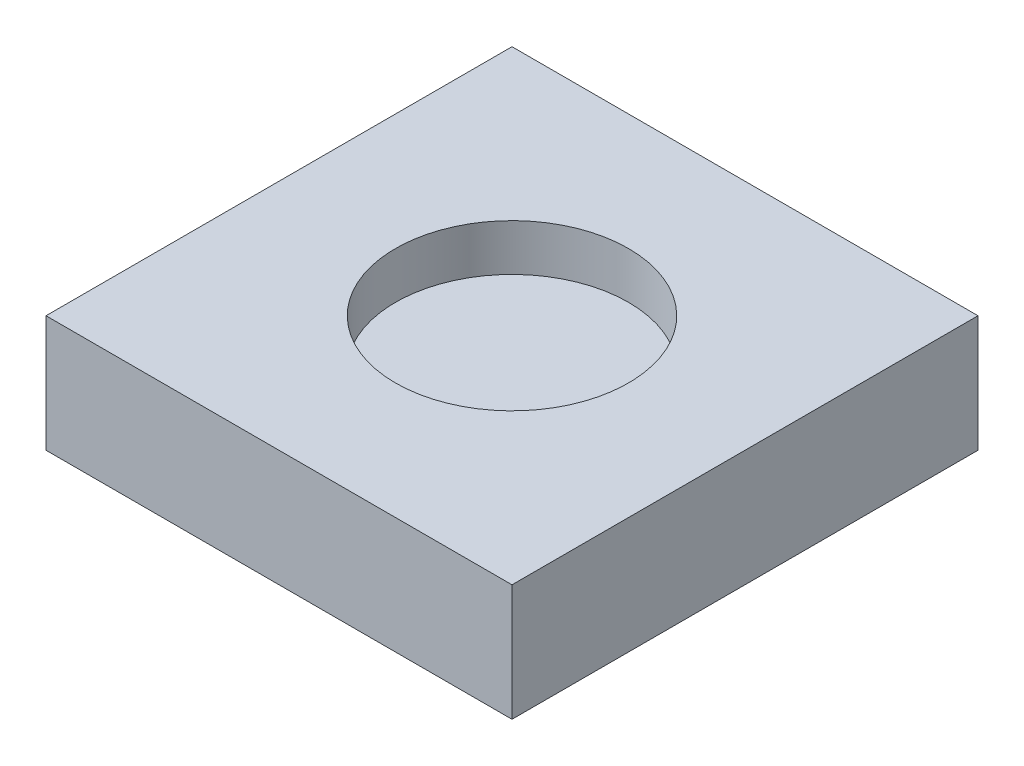
ISO-10303-21;
HEADER;
FILE_DESCRIPTION(('STEP AP214'),'2;1');
FILE_NAME('part.step','',(''),(''),'','','');
FILE_SCHEMA(('AUTOMOTIVE_DESIGN { 1 0 10303 214 1 1 1 1 }'));
ENDSEC;
DATA;
#1=APPLICATION_CONTEXT('core data for automotive mechanical design processes');
#2=APPLICATION_PROTOCOL_DEFINITION('international standard','automotive_design',2000,#1);
#3=PRODUCT_CONTEXT('',#1,'mechanical');
#4=PRODUCT('Part','Part','',(#3));
#5=PRODUCT_RELATED_PRODUCT_CATEGORY('part','',(#4));
#6=PRODUCT_DEFINITION_FORMATION('','',#4);
#7=PRODUCT_DEFINITION_CONTEXT('part definition',#1,'design');
#8=PRODUCT_DEFINITION('design','',#6,#7);
#9=PRODUCT_DEFINITION_SHAPE('','',#8);
#10=(LENGTH_UNIT() NAMED_UNIT(*) SI_UNIT(.MILLI.,.METRE.));
#11=(NAMED_UNIT(*) PLANE_ANGLE_UNIT() SI_UNIT($,.RADIAN.));
#12=(NAMED_UNIT(*) SI_UNIT($,.STERADIAN.) SOLID_ANGLE_UNIT());
#13=UNCERTAINTY_MEASURE_WITH_UNIT(LENGTH_MEASURE(1.E-05),#10,'distance_accuracy_value','');
#14=(GEOMETRIC_REPRESENTATION_CONTEXT(3) GLOBAL_UNCERTAINTY_ASSIGNED_CONTEXT((#13)) GLOBAL_UNIT_ASSIGNED_CONTEXT((#10,
#11,#12)) REPRESENTATION_CONTEXT('',''));
#15=CARTESIAN_POINT('',(0.,0.,0.));
#16=DIRECTION('',(0.,0.,1.));
#17=DIRECTION('',(1.,0.,0.));
#18=AXIS2_PLACEMENT_3D('',#15,#16,#17);
#19=CARTESIAN_POINT('',(10.,5.,10.));
#20=DIRECTION('',(-1.,0.,0.));
#21=DIRECTION('',(0.,0.,1.));
#22=AXIS2_PLACEMENT_3D('',#19,#20,#21);
#23=PLANE('',#22);
#24=DIRECTION('',(0.,0.,-1.));
#25=VECTOR('',#24,1.);
#26=CARTESIAN_POINT('',(10.,0.,10.));
#27=LINE('',#26,#25);
#28=CARTESIAN_POINT('',(10.,0.,10.));
#29=VERTEX_POINT('',#28);
#30=CARTESIAN_POINT('',(10.,0.,-10.));
#31=VERTEX_POINT('',#30);
#32=EDGE_CURVE('E100',#29,#31,#27,.T.);
#33=ORIENTED_EDGE('',*,*,#32,.T.);
#34=DIRECTION('',(0.,-1.,0.));
#35=VECTOR('',#34,1.);
#36=CARTESIAN_POINT('',(10.,5.,-10.));
#37=LINE('',#36,#35);
#38=CARTESIAN_POINT('',(10.,5.,-10.));
#39=VERTEX_POINT('',#38);
#40=EDGE_CURVE('E42',#39,#31,#37,.T.);
#41=ORIENTED_EDGE('',*,*,#40,.F.);
#42=DIRECTION('',(0.,0.,-1.));
#43=VECTOR('',#42,1.);
#44=CARTESIAN_POINT('',(10.,5.,10.));
#45=LINE('',#44,#43);
#46=CARTESIAN_POINT('',(10.,5.,10.));
#47=VERTEX_POINT('',#46);
#48=EDGE_CURVE('E86',#47,#39,#45,.T.);
#49=ORIENTED_EDGE('',*,*,#48,.F.);
#50=DIRECTION('',(0.,-1.,0.));
#51=VECTOR('',#50,1.);
#52=CARTESIAN_POINT('',(10.,5.,10.));
#53=LINE('',#52,#51);
#54=EDGE_CURVE('E96',#47,#29,#53,.T.);
#55=ORIENTED_EDGE('',*,*,#54,.T.);
#56=EDGE_LOOP('',(#33,#41,#49,#55));
#57=FACE_BOUND('',#56,.T.);
#58=ADVANCED_FACE('F33',(#57),#23,.F.);
#59=CARTESIAN_POINT('',(-10.,5.,-10.));
#60=DIRECTION('',(0.,0.,1.));
#61=DIRECTION('',(1.,0.,0.));
#62=AXIS2_PLACEMENT_3D('',#59,#60,#61);
#63=PLANE('',#62);
#64=DIRECTION('',(-1.,0.,0.));
#65=VECTOR('',#64,1.);
#66=CARTESIAN_POINT('',(-10.,0.,-10.));
#67=LINE('',#66,#65);
#68=CARTESIAN_POINT('',(-10.,0.,-10.));
#69=VERTEX_POINT('',#68);
#70=EDGE_CURVE('E91',#31,#69,#67,.T.);
#71=ORIENTED_EDGE('',*,*,#70,.T.);
#72=DIRECTION('',(0.,-1.,0.));
#73=VECTOR('',#72,1.);
#74=CARTESIAN_POINT('',(-10.,5.,-10.));
#75=LINE('',#74,#73);
#76=CARTESIAN_POINT('',(-10.,5.,-10.));
#77=VERTEX_POINT('',#76);
#78=EDGE_CURVE('E89',#77,#69,#75,.T.);
#79=ORIENTED_EDGE('',*,*,#78,.F.);
#80=DIRECTION('',(-1.,0.,0.));
#81=VECTOR('',#80,1.);
#82=CARTESIAN_POINT('',(-10.,5.,-10.));
#83=LINE('',#82,#81);
#84=EDGE_CURVE('E81',#39,#77,#83,.T.);
#85=ORIENTED_EDGE('',*,*,#84,.F.);
#86=ORIENTED_EDGE('',*,*,#40,.T.);
#87=EDGE_LOOP('',(#71,#79,#85,#86));
#88=FACE_BOUND('',#87,.T.);
#89=ADVANCED_FACE('F90',(#88),#63,.F.);
#90=CARTESIAN_POINT('',(-10.,5.,10.));
#91=DIRECTION('',(1.,0.,0.));
#92=DIRECTION('',(0.,0.,-1.));
#93=AXIS2_PLACEMENT_3D('',#90,#91,#92);
#94=PLANE('',#93);
#95=DIRECTION('',(0.,0.,1.));
#96=VECTOR('',#95,1.);
#97=CARTESIAN_POINT('',(-10.,0.,10.));
#98=LINE('',#97,#96);
#99=CARTESIAN_POINT('',(-10.,0.,10.));
#100=VERTEX_POINT('',#99);
#101=EDGE_CURVE('E67',#69,#100,#98,.T.);
#102=ORIENTED_EDGE('',*,*,#101,.T.);
#103=DIRECTION('',(0.,-1.,0.));
#104=VECTOR('',#103,1.);
#105=CARTESIAN_POINT('',(-10.,5.,10.));
#106=LINE('',#105,#104);
#107=CARTESIAN_POINT('',(-10.,5.,10.));
#108=VERTEX_POINT('',#107);
#109=EDGE_CURVE('E92',#108,#100,#106,.T.);
#110=ORIENTED_EDGE('',*,*,#109,.F.);
#111=DIRECTION('',(0.,0.,1.));
#112=VECTOR('',#111,1.);
#113=CARTESIAN_POINT('',(-10.,5.,10.));
#114=LINE('',#113,#112);
#115=EDGE_CURVE('E84',#77,#108,#114,.T.);
#116=ORIENTED_EDGE('',*,*,#115,.F.);
#117=ORIENTED_EDGE('',*,*,#78,.T.);
#118=EDGE_LOOP('',(#102,#110,#116,#117));
#119=FACE_BOUND('',#118,.T.);
#120=ADVANCED_FACE('F94',(#119),#94,.F.);
#121=CARTESIAN_POINT('',(-10.,5.,10.));
#122=DIRECTION('',(0.,0.,-1.));
#123=DIRECTION('',(-1.,0.,0.));
#124=AXIS2_PLACEMENT_3D('',#121,#122,#123);
#125=PLANE('',#124);
#126=DIRECTION('',(1.,0.,0.));
#127=VECTOR('',#126,1.);
#128=CARTESIAN_POINT('',(-10.,0.,10.));
#129=LINE('',#128,#127);
#130=EDGE_CURVE('E73',#100,#29,#129,.T.);
#131=ORIENTED_EDGE('',*,*,#130,.T.);
#132=ORIENTED_EDGE('',*,*,#54,.F.);
#133=DIRECTION('',(1.,0.,0.));
#134=VECTOR('',#133,1.);
#135=CARTESIAN_POINT('',(-10.,5.,10.));
#136=LINE('',#135,#134);
#137=EDGE_CURVE('E50',#108,#47,#136,.T.);
#138=ORIENTED_EDGE('',*,*,#137,.F.);
#139=ORIENTED_EDGE('',*,*,#109,.T.);
#140=EDGE_LOOP('',(#131,#132,#138,#139));
#141=FACE_BOUND('',#140,.T.);
#142=ADVANCED_FACE('F123',(#141),#125,.F.);
#143=CARTESIAN_POINT('',(0.,5.,0.));
#144=DIRECTION('',(0.,-1.,0.));
#145=DIRECTION('',(0.,0.,-1.));
#146=AXIS2_PLACEMENT_3D('',#143,#144,#145);
#147=PLANE('',#146);
#148=CARTESIAN_POINT('',(0.,5.,0.));
#149=DIRECTION('',(0.,1.,0.));
#150=DIRECTION('',(0.,0.,1.));
#151=AXIS2_PLACEMENT_3D('',#148,#149,#150);
#152=CIRCLE('',#151,5.);
#153=CARTESIAN_POINT('',(0.,5.,5.));
#154=VERTEX_POINT('',#153);
#155=EDGE_CURVE('E189',#154,#154,#152,.T.);
#156=ORIENTED_EDGE('',*,*,#155,.F.);
#157=EDGE_LOOP('',(#156));
#158=FACE_BOUND('',#157,.T.);
#159=ORIENTED_EDGE('',*,*,#48,.T.);
#160=ORIENTED_EDGE('',*,*,#84,.T.);
#161=ORIENTED_EDGE('',*,*,#115,.T.);
#162=ORIENTED_EDGE('',*,*,#137,.T.);
#163=EDGE_LOOP('',(#159,#160,#161,#162));
#164=FACE_BOUND('',#163,.T.);
#165=ADVANCED_FACE('F82',(#158,#164),#147,.F.);
#166=CARTESIAN_POINT('',(0.,0.,0.));
#167=DIRECTION('',(0.,-1.,0.));
#168=DIRECTION('',(0.,0.,-1.));
#169=AXIS2_PLACEMENT_3D('',#166,#167,#168);
#170=PLANE('',#169);
#171=CARTESIAN_POINT('',(0.,0.,0.));
#172=DIRECTION('',(0.,-1.,0.));
#173=DIRECTION('',(0.,0.,-1.));
#174=AXIS2_PLACEMENT_3D('',#171,#172,#173);
#175=CIRCLE('',#174,1.);
#176=CARTESIAN_POINT('',(0.,0.,-1.));
#177=VERTEX_POINT('',#176);
#178=EDGE_CURVE('E188',#177,#177,#175,.T.);
#179=ORIENTED_EDGE('',*,*,#178,.F.);
#180=EDGE_LOOP('',(#179));
#181=FACE_BOUND('',#180,.T.);
#182=ORIENTED_EDGE('',*,*,#32,.F.);
#183=ORIENTED_EDGE('',*,*,#130,.F.);
#184=ORIENTED_EDGE('',*,*,#101,.F.);
#185=ORIENTED_EDGE('',*,*,#70,.F.);
#186=EDGE_LOOP('',(#182,#183,#184,#185));
#187=FACE_BOUND('',#186,.T.);
#188=ADVANCED_FACE('F111',(#181,#187),#170,.T.);
#189=CARTESIAN_POINT('',(0.,3.,0.));
#190=DIRECTION('',(0.,1.,0.));
#191=DIRECTION('',(0.,0.,1.));
#192=AXIS2_PLACEMENT_3D('',#189,#190,#191);
#193=CYLINDRICAL_SURFACE('',#192,5.);
#194=CARTESIAN_POINT('',(0.,3.,0.));
#195=DIRECTION('',(0.,1.,0.));
#196=DIRECTION('',(0.,0.,1.));
#197=AXIS2_PLACEMENT_3D('',#194,#195,#196);
#198=CIRCLE('',#197,5.);
#199=CARTESIAN_POINT('',(0.,3.,5.));
#200=VERTEX_POINT('',#199);
#201=EDGE_CURVE('E103',#200,#200,#198,.T.);
#202=ORIENTED_EDGE('',*,*,#201,.F.);
#203=EDGE_LOOP('',(#202));
#204=FACE_BOUND('',#203,.T.);
#205=ORIENTED_EDGE('',*,*,#155,.T.);
#206=EDGE_LOOP('',(#205));
#207=FACE_BOUND('',#206,.T.);
#208=ADVANCED_FACE('F113',(#204,#207),#193,.F.);
#209=CARTESIAN_POINT('',(0.,3.,0.));
#210=DIRECTION('',(0.,1.,0.));
#211=DIRECTION('',(0.,0.,1.));
#212=AXIS2_PLACEMENT_3D('',#209,#210,#211);
#213=PLANE('',#212);
#214=ORIENTED_EDGE('',*,*,#201,.T.);
#215=EDGE_LOOP('',(#214));
#216=FACE_BOUND('',#215,.T.);
#217=ADVANCED_FACE('F120',(#216),#213,.T.);
#218=CARTESIAN_POINT('',(0.,2.,0.));
#219=DIRECTION('',(0.,-1.,0.));
#220=DIRECTION('',(0.,0.,-1.));
#221=AXIS2_PLACEMENT_3D('',#218,#219,#220);
#222=CYLINDRICAL_SURFACE('',#221,1.);
#223=CARTESIAN_POINT('',(0.,1.,0.));
#224=DIRECTION('',(0.,-1.,0.));
#225=DIRECTION('',(0.,0.,-1.));
#226=AXIS2_PLACEMENT_3D('',#223,#224,#225);
#227=CIRCLE('',#226,1.);
#228=CARTESIAN_POINT('',(0.,1.,-1.));
#229=VERTEX_POINT('',#228);
#230=EDGE_CURVE('E11',#229,#229,#227,.F.);
#231=ORIENTED_EDGE('',*,*,#230,.T.);
#232=EDGE_LOOP('',(#231));
#233=FACE_BOUND('',#232,.T.);
#234=ORIENTED_EDGE('',*,*,#178,.T.);
#235=EDGE_LOOP('',(#234));
#236=FACE_BOUND('',#235,.T.);
#237=ADVANCED_FACE('F159',(#233,#236),#222,.F.);
#238=CARTESIAN_POINT('',(0.,1.,0.));
#239=DIRECTION('',(0.,-1.,0.));
#240=DIRECTION('',(0.,0.,-1.));
#241=AXIS2_PLACEMENT_3D('',#238,#239,#240);
#242=SPHERICAL_SURFACE('',#241,1.);
#243=ORIENTED_EDGE('',*,*,#230,.F.);
#244=EDGE_LOOP('',(#243));
#245=FACE_BOUND('',#244,.T.);
#246=ADVANCED_FACE('F35',(#245),#242,.F.);
#247=CLOSED_SHELL('',(#58,#89,#120,#142,#165,#188,#208,#217,#237,#246));
#248=MANIFOLD_SOLID_BREP('B2',#247);
#249=ADVANCED_BREP_SHAPE_REPRESENTATION('',(#18,#248),#14);
#250=SHAPE_DEFINITION_REPRESENTATION(#9,#249);
ENDSEC;
END-ISO-10303-21;
